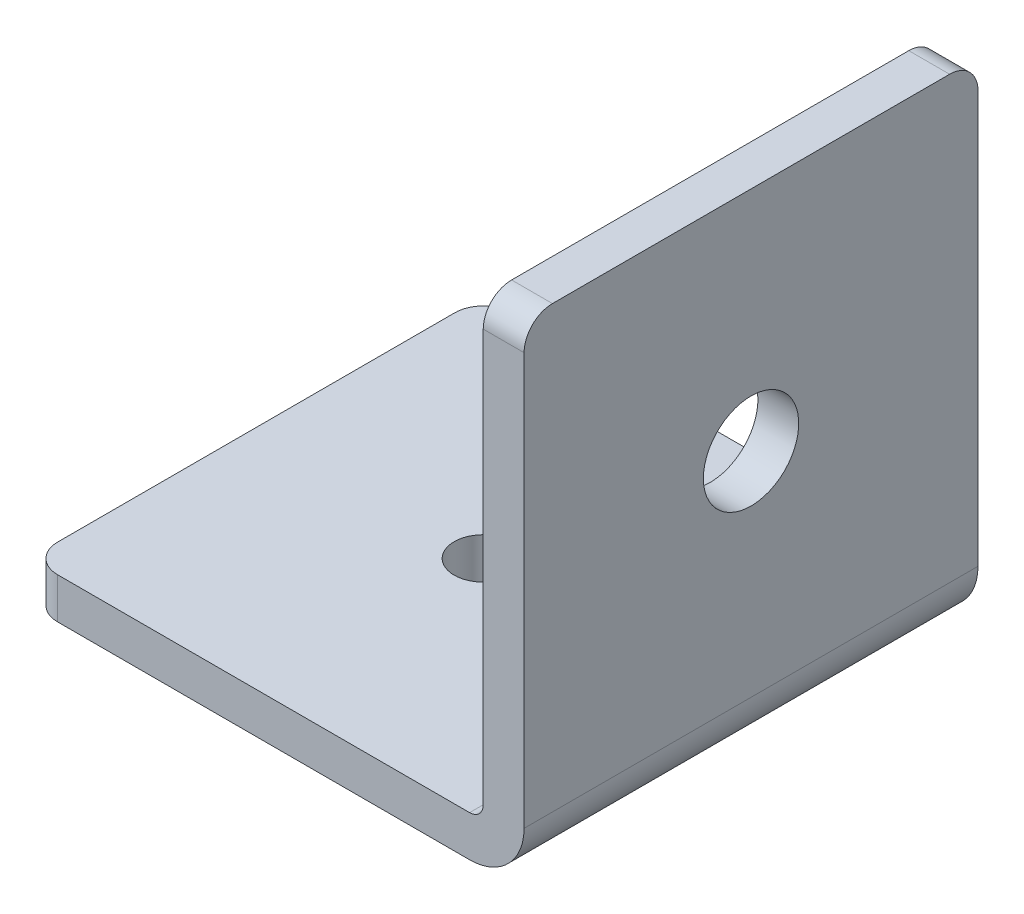
ISO-10303-21;
HEADER;
FILE_DESCRIPTION(('STEP AP214'),'2;1');
FILE_NAME('part.step','',(''),(''),'','','');
FILE_SCHEMA(('AUTOMOTIVE_DESIGN { 1 0 10303 214 1 1 1 1 }'));
ENDSEC;
DATA;
#1=APPLICATION_CONTEXT('core data for automotive mechanical design processes');
#2=APPLICATION_PROTOCOL_DEFINITION('international standard','automotive_design',2000,#1);
#3=PRODUCT_CONTEXT('',#1,'mechanical');
#4=PRODUCT('Part','Part','',(#3));
#5=PRODUCT_RELATED_PRODUCT_CATEGORY('part','',(#4));
#6=PRODUCT_DEFINITION_FORMATION('','',#4);
#7=PRODUCT_DEFINITION_CONTEXT('part definition',#1,'design');
#8=PRODUCT_DEFINITION('design','',#6,#7);
#9=PRODUCT_DEFINITION_SHAPE('','',#8);
#10=(LENGTH_UNIT() NAMED_UNIT(*) SI_UNIT(.MILLI.,.METRE.));
#11=(NAMED_UNIT(*) PLANE_ANGLE_UNIT() SI_UNIT($,.RADIAN.));
#12=(NAMED_UNIT(*) SI_UNIT($,.STERADIAN.) SOLID_ANGLE_UNIT());
#13=UNCERTAINTY_MEASURE_WITH_UNIT(LENGTH_MEASURE(1.E-05),#10,'distance_accuracy_value','');
#14=(GEOMETRIC_REPRESENTATION_CONTEXT(3) GLOBAL_UNCERTAINTY_ASSIGNED_CONTEXT((#13)) GLOBAL_UNIT_ASSIGNED_CONTEXT((#10,
#11,#12)) REPRESENTATION_CONTEXT('',''));
#15=CARTESIAN_POINT('',(0.,0.,0.));
#16=DIRECTION('',(0.,0.,1.));
#17=DIRECTION('',(1.,0.,0.));
#18=AXIS2_PLACEMENT_3D('',#15,#16,#17);
#19=CARTESIAN_POINT('',(25.4,27.686,-23.8125));
#20=DIRECTION('',(0.,-1.,0.));
#21=DIRECTION('',(1.,0.,0.));
#22=AXIS2_PLACEMENT_3D('',#19,#20,#21);
#23=PLANE('',#22);
#24=DIRECTION('',(1.,0.,0.));
#25=VECTOR('',#24,1.);
#26=CARTESIAN_POINT('',(26.543,27.686,-23.8125000006512));
#27=LINE('',#26,#25);
#28=CARTESIAN_POINT('',(27.686,27.686,-23.8125000003256));
#29=VERTEX_POINT('',#28);
#30=CARTESIAN_POINT('',(25.4,27.686,-23.8125000003256));
#31=VERTEX_POINT('',#30);
#32=EDGE_CURVE('E90',#29,#31,#27,.F.);
#33=ORIENTED_EDGE('',*,*,#32,.T.);
#34=DIRECTION('',(0.,0.,-1.));
#35=VECTOR('',#34,1.);
#36=CARTESIAN_POINT('',(25.4,27.686,-12.7));
#37=LINE('',#36,#35);
#38=CARTESIAN_POINT('',(25.4,27.686,-1.5875000003256));
#39=VERTEX_POINT('',#38);
#40=EDGE_CURVE('E80',#39,#31,#37,.T.);
#41=ORIENTED_EDGE('',*,*,#40,.F.);
#42=DIRECTION('',(-1.,0.,0.));
#43=VECTOR('',#42,1.);
#44=CARTESIAN_POINT('',(26.543,27.686,-1.5875000006512));
#45=LINE('',#44,#43);
#46=CARTESIAN_POINT('',(27.686,27.686,-1.5875000003256));
#47=VERTEX_POINT('',#46);
#48=EDGE_CURVE('E106',#39,#47,#45,.F.);
#49=ORIENTED_EDGE('',*,*,#48,.T.);
#50=DIRECTION('',(0.,0.,-1.));
#51=VECTOR('',#50,1.);
#52=CARTESIAN_POINT('',(27.686,27.686,-12.7));
#53=LINE('',#52,#51);
#54=EDGE_CURVE('E94',#47,#29,#53,.T.);
#55=ORIENTED_EDGE('',*,*,#54,.T.);
#56=EDGE_LOOP('',(#33,#41,#49,#55));
#57=FACE_BOUND('',#56,.T.);
#58=ADVANCED_FACE('F17',(#57),#23,.F.);
#59=CARTESIAN_POINT('',(27.686,14.986,-12.7));
#60=DIRECTION('',(-1.,0.,0.));
#61=DIRECTION('',(0.,0.,1.));
#62=AXIS2_PLACEMENT_3D('',#59,#60,#61);
#63=CYLINDRICAL_SURFACE('',#62,2.667);
#64=CARTESIAN_POINT('',(25.4,14.986,-12.7));
#65=DIRECTION('',(-1.,0.,0.));
#66=DIRECTION('',(0.,0.,1.));
#67=AXIS2_PLACEMENT_3D('',#64,#65,#66);
#68=CIRCLE('',#67,2.667);
#69=CARTESIAN_POINT('',(25.4,14.986,-10.033));
#70=VERTEX_POINT('',#69);
#71=EDGE_CURVE('E102',#70,#70,#68,.F.);
#72=ORIENTED_EDGE('',*,*,#71,.F.);
#73=EDGE_LOOP('',(#72));
#74=FACE_BOUND('',#73,.T.);
#75=CARTESIAN_POINT('',(27.686,14.986,-12.7));
#76=DIRECTION('',(-1.,0.,0.));
#77=DIRECTION('',(0.,0.,1.));
#78=AXIS2_PLACEMENT_3D('',#75,#76,#77);
#79=CIRCLE('',#78,2.667);
#80=CARTESIAN_POINT('',(27.686,14.986,-10.033));
#81=VERTEX_POINT('',#80);
#82=EDGE_CURVE('E114',#81,#81,#79,.F.);
#83=ORIENTED_EDGE('',*,*,#82,.T.);
#84=EDGE_LOOP('',(#83));
#85=FACE_BOUND('',#84,.T.);
#86=ADVANCED_FACE('F371',(#74,#85),#63,.F.);
#87=CARTESIAN_POINT('',(27.686,26.0985,-23.8125));
#88=DIRECTION('',(-1.,0.,0.));
#89=DIRECTION('',(0.,0.,1.));
#90=AXIS2_PLACEMENT_3D('',#87,#88,#89);
#91=CYLINDRICAL_SURFACE('',#90,1.58749999999999);
#92=CARTESIAN_POINT('',(27.686,26.0985,-23.8125));
#93=DIRECTION('',(-1.,0.,0.));
#94=DIRECTION('',(0.,0.,1.));
#95=AXIS2_PLACEMENT_3D('',#92,#93,#94);
#96=CIRCLE('',#95,1.58749999999999);
#97=CARTESIAN_POINT('',(27.686,26.0985,-25.4));
#98=VERTEX_POINT('',#97);
#99=EDGE_CURVE('E112',#29,#98,#96,.T.);
#100=ORIENTED_EDGE('',*,*,#99,.T.);
#101=DIRECTION('',(-1.,0.,0.));
#102=VECTOR('',#101,1.);
#103=CARTESIAN_POINT('',(14.63675,26.0985,-25.4));
#104=LINE('',#103,#102);
#105=CARTESIAN_POINT('',(25.3999999983807,26.0985,-25.4));
#106=VERTEX_POINT('',#105);
#107=EDGE_CURVE('E101',#98,#106,#104,.T.);
#108=ORIENTED_EDGE('',*,*,#107,.T.);
#109=CARTESIAN_POINT('',(25.4,26.0985,-23.8125));
#110=DIRECTION('',(-1.,0.,0.));
#111=DIRECTION('',(0.,0.,1.));
#112=AXIS2_PLACEMENT_3D('',#109,#110,#111);
#113=CIRCLE('',#112,1.58749999999999);
#114=EDGE_CURVE('E21',#31,#106,#113,.T.);
#115=ORIENTED_EDGE('',*,*,#114,.F.);
#116=ORIENTED_EDGE('',*,*,#32,.F.);
#117=EDGE_LOOP('',(#100,#108,#115,#116));
#118=FACE_BOUND('',#117,.T.);
#119=ADVANCED_FACE('F99',(#118),#91,.T.);
#120=CARTESIAN_POINT('',(25.4,27.686,-25.4));
#121=DIRECTION('',(-1.,0.,0.));
#122=DIRECTION('',(0.,-1.,0.));
#123=AXIS2_PLACEMENT_3D('',#120,#121,#122);
#124=PLANE('',#123);
#125=ORIENTED_EDGE('',*,*,#71,.T.);
#126=EDGE_LOOP('',(#125));
#127=FACE_BOUND('',#126,.T.);
#128=ORIENTED_EDGE('',*,*,#114,.T.);
#129=DIRECTION('',(0.,-1.,0.));
#130=VECTOR('',#129,1.);
#131=CARTESIAN_POINT('',(25.3999999967615,13.04925,-25.4));
#132=LINE('',#131,#130);
#133=CARTESIAN_POINT('',(25.3999999983808,3.04799999984371,-25.4));
#134=VERTEX_POINT('',#133);
#135=EDGE_CURVE('E156',#106,#134,#132,.T.);
#136=ORIENTED_EDGE('',*,*,#135,.T.);
#137=DIRECTION('',(0.,0.,1.));
#138=VECTOR('',#137,1.);
#139=CARTESIAN_POINT('',(25.4,3.04799999968742,-12.7));
#140=LINE('',#139,#138);
#141=CARTESIAN_POINT('',(25.3999999983808,3.04799999984371,0.));
#142=VERTEX_POINT('',#141);
#143=EDGE_CURVE('E126',#142,#134,#140,.F.);
#144=ORIENTED_EDGE('',*,*,#143,.F.);
#145=DIRECTION('',(0.,1.,0.));
#146=VECTOR('',#145,1.);
#147=CARTESIAN_POINT('',(25.3999999967615,13.04925,0.));
#148=LINE('',#147,#146);
#149=CARTESIAN_POINT('',(25.3999999983807,26.0985,0.));
#150=VERTEX_POINT('',#149);
#151=EDGE_CURVE('E128',#142,#150,#148,.T.);
#152=ORIENTED_EDGE('',*,*,#151,.T.);
#153=CARTESIAN_POINT('',(25.4,26.0985,-1.5875));
#154=DIRECTION('',(-1.,0.,0.));
#155=DIRECTION('',(0.,0.,1.));
#156=AXIS2_PLACEMENT_3D('',#153,#154,#155);
#157=CIRCLE('',#156,1.58749999999999);
#158=EDGE_CURVE('E87',#150,#39,#157,.T.);
#159=ORIENTED_EDGE('',*,*,#158,.T.);
#160=ORIENTED_EDGE('',*,*,#40,.T.);
#161=EDGE_LOOP('',(#128,#136,#144,#152,#159,#160));
#162=FACE_BOUND('',#161,.T.);
#163=ADVANCED_FACE('F82',(#127,#162),#124,.T.);
#164=CARTESIAN_POINT('',(27.686,26.0985,-1.5875));
#165=DIRECTION('',(-1.,0.,0.));
#166=DIRECTION('',(0.,0.,1.));
#167=AXIS2_PLACEMENT_3D('',#164,#165,#166);
#168=CYLINDRICAL_SURFACE('',#167,1.58749999999999);
#169=CARTESIAN_POINT('',(27.686,26.0985,-1.5875));
#170=DIRECTION('',(-1.,0.,0.));
#171=DIRECTION('',(0.,0.,1.));
#172=AXIS2_PLACEMENT_3D('',#169,#170,#171);
#173=CIRCLE('',#172,1.58749999999999);
#174=CARTESIAN_POINT('',(27.686,26.0985,0.));
#175=VERTEX_POINT('',#174);
#176=EDGE_CURVE('E109',#175,#47,#173,.T.);
#177=ORIENTED_EDGE('',*,*,#176,.T.);
#178=ORIENTED_EDGE('',*,*,#48,.F.);
#179=ORIENTED_EDGE('',*,*,#158,.F.);
#180=DIRECTION('',(1.,0.,0.));
#181=VECTOR('',#180,1.);
#182=CARTESIAN_POINT('',(14.63675,26.0985,0.));
#183=LINE('',#182,#181);
#184=EDGE_CURVE('E158',#150,#175,#183,.T.);
#185=ORIENTED_EDGE('',*,*,#184,.T.);
#186=EDGE_LOOP('',(#177,#178,#179,#185));
#187=FACE_BOUND('',#186,.T.);
#188=ADVANCED_FACE('F245',(#187),#168,.T.);
#189=CARTESIAN_POINT('',(27.686,27.686,-25.4));
#190=DIRECTION('',(-1.,0.,0.));
#191=DIRECTION('',(0.,-1.,0.));
#192=AXIS2_PLACEMENT_3D('',#189,#190,#191);
#193=PLANE('',#192);
#194=ORIENTED_EDGE('',*,*,#82,.F.);
#195=EDGE_LOOP('',(#194));
#196=FACE_BOUND('',#195,.T.);
#197=DIRECTION('',(0.,0.,1.));
#198=VECTOR('',#197,1.);
#199=CARTESIAN_POINT('',(27.686,3.04799999874969,-12.7));
#200=LINE('',#199,#198);
#201=CARTESIAN_POINT('',(27.686,3.04799999937484,0.));
#202=VERTEX_POINT('',#201);
#203=CARTESIAN_POINT('',(27.686,3.04799999937484,-25.4));
#204=VERTEX_POINT('',#203);
#205=EDGE_CURVE('E117',#202,#204,#200,.F.);
#206=ORIENTED_EDGE('',*,*,#205,.T.);
#207=DIRECTION('',(0.,1.,0.));
#208=VECTOR('',#207,1.);
#209=CARTESIAN_POINT('',(27.686,13.04925,-25.4));
#210=LINE('',#209,#208);
#211=EDGE_CURVE('E121',#204,#98,#210,.T.);
#212=ORIENTED_EDGE('',*,*,#211,.T.);
#213=ORIENTED_EDGE('',*,*,#99,.F.);
#214=ORIENTED_EDGE('',*,*,#54,.F.);
#215=ORIENTED_EDGE('',*,*,#176,.F.);
#216=DIRECTION('',(0.,-1.,0.));
#217=VECTOR('',#216,1.);
#218=CARTESIAN_POINT('',(27.686,13.04925,0.));
#219=LINE('',#218,#217);
#220=EDGE_CURVE('E133',#175,#202,#219,.T.);
#221=ORIENTED_EDGE('',*,*,#220,.T.);
#222=EDGE_LOOP('',(#206,#212,#213,#214,#215,#221));
#223=FACE_BOUND('',#222,.T.);
#224=ADVANCED_FACE('F243',(#196,#223),#193,.F.);
#225=CARTESIAN_POINT('',(24.638,3.048,0.));
#226=DIRECTION('',(0.,0.,-1.));
#227=DIRECTION('',(-1.,0.,0.));
#228=AXIS2_PLACEMENT_3D('',#225,#226,#227);
#229=CYLINDRICAL_SURFACE('',#228,3.048);
#230=DIRECTION('',(0.,0.,1.));
#231=VECTOR('',#230,1.);
#232=CARTESIAN_POINT('',(24.638,0.,-12.7));
#233=LINE('',#232,#231);
#234=CARTESIAN_POINT('',(24.638,0.,-25.4));
#235=VERTEX_POINT('',#234);
#236=CARTESIAN_POINT('',(24.638,0.,0.));
#237=VERTEX_POINT('',#236);
#238=EDGE_CURVE('E132',#235,#237,#233,.T.);
#239=ORIENTED_EDGE('',*,*,#238,.F.);
#240=CARTESIAN_POINT('',(24.638,3.048,-25.4));
#241=DIRECTION('',(0.,0.,-1.));
#242=DIRECTION('',(-1.,0.,0.));
#243=AXIS2_PLACEMENT_3D('',#240,#241,#242);
#244=CIRCLE('',#243,3.048);
#245=EDGE_CURVE('E118',#235,#204,#244,.F.);
#246=ORIENTED_EDGE('',*,*,#245,.T.);
#247=ORIENTED_EDGE('',*,*,#205,.F.);
#248=CARTESIAN_POINT('',(24.638,3.048,0.));
#249=DIRECTION('',(0.,0.,-1.));
#250=DIRECTION('',(-1.,0.,0.));
#251=AXIS2_PLACEMENT_3D('',#248,#249,#250);
#252=CIRCLE('',#251,3.048);
#253=EDGE_CURVE('E129',#202,#237,#252,.T.);
#254=ORIENTED_EDGE('',*,*,#253,.T.);
#255=EDGE_LOOP('',(#239,#246,#247,#254));
#256=FACE_BOUND('',#255,.T.);
#257=ADVANCED_FACE('F238',(#256),#229,.T.);
#258=CARTESIAN_POINT('',(1.5875,0.,-1.5875));
#259=DIRECTION('',(0.,1.,0.));
#260=DIRECTION('',(0.,0.,1.));
#261=AXIS2_PLACEMENT_3D('',#258,#259,#260);
#262=CYLINDRICAL_SURFACE('',#261,1.5875);
#263=CARTESIAN_POINT('',(1.5875,0.,-1.5875));
#264=DIRECTION('',(0.,1.,0.));
#265=DIRECTION('',(0.,0.,1.));
#266=AXIS2_PLACEMENT_3D('',#263,#264,#265);
#267=CIRCLE('',#266,1.5875);
#268=CARTESIAN_POINT('',(1.5875,0.,0.));
#269=VERTEX_POINT('',#268);
#270=CARTESIAN_POINT('',(0.,0.,-1.5875));
#271=VERTEX_POINT('',#270);
#272=EDGE_CURVE('E134',#269,#271,#267,.F.);
#273=ORIENTED_EDGE('',*,*,#272,.F.);
#274=DIRECTION('',(0.,1.,0.));
#275=VECTOR('',#274,1.);
#276=CARTESIAN_POINT('',(1.5875,13.04925,0.));
#277=LINE('',#276,#275);
#278=CARTESIAN_POINT('',(1.5875,2.286,0.));
#279=VERTEX_POINT('',#278);
#280=EDGE_CURVE('E125',#269,#279,#277,.T.);
#281=ORIENTED_EDGE('',*,*,#280,.T.);
#282=CARTESIAN_POINT('',(1.5875,2.286,-1.5875));
#283=DIRECTION('',(0.,1.,0.));
#284=DIRECTION('',(0.,0.,1.));
#285=AXIS2_PLACEMENT_3D('',#282,#283,#284);
#286=CIRCLE('',#285,1.5875);
#287=CARTESIAN_POINT('',(0.,2.286,-1.5875));
#288=VERTEX_POINT('',#287);
#289=EDGE_CURVE('E143',#279,#288,#286,.F.);
#290=ORIENTED_EDGE('',*,*,#289,.T.);
#291=DIRECTION('',(0.,-1.,0.));
#292=VECTOR('',#291,1.);
#293=CARTESIAN_POINT('',(0.,1.143,-1.5875));
#294=LINE('',#293,#292);
#295=EDGE_CURVE('E163',#288,#271,#294,.T.);
#296=ORIENTED_EDGE('',*,*,#295,.T.);
#297=EDGE_LOOP('',(#273,#281,#290,#296));
#298=FACE_BOUND('',#297,.T.);
#299=ADVANCED_FACE('F273',(#298),#262,.T.);
#300=CARTESIAN_POINT('',(0.,0.,-1.5875));
#301=DIRECTION('',(1.,0.,0.));
#302=DIRECTION('',(0.,0.,-1.));
#303=AXIS2_PLACEMENT_3D('',#300,#301,#302);
#304=PLANE('',#303);
#305=DIRECTION('',(0.,1.,0.));
#306=VECTOR('',#305,1.);
#307=CARTESIAN_POINT('',(0.,1.143,-23.8125000006107));
#308=LINE('',#307,#306);
#309=CARTESIAN_POINT('',(0.,2.286,-23.8125000003053));
#310=VERTEX_POINT('',#309);
#311=CARTESIAN_POINT('',(0.,0.,-23.8125000003053));
#312=VERTEX_POINT('',#311);
#313=EDGE_CURVE('E168',#310,#312,#308,.F.);
#314=ORIENTED_EDGE('',*,*,#313,.T.);
#315=DIRECTION('',(0.,0.,-1.));
#316=VECTOR('',#315,1.);
#317=CARTESIAN_POINT('',(0.,0.,-12.7));
#318=LINE('',#317,#316);
#319=EDGE_CURVE('E137',#271,#312,#318,.T.);
#320=ORIENTED_EDGE('',*,*,#319,.F.);
#321=ORIENTED_EDGE('',*,*,#295,.F.);
#322=DIRECTION('',(0.,0.,-1.));
#323=VECTOR('',#322,1.);
#324=CARTESIAN_POINT('',(0.,2.286,-12.7));
#325=LINE('',#324,#323);
#326=EDGE_CURVE('E146',#288,#310,#325,.T.);
#327=ORIENTED_EDGE('',*,*,#326,.T.);
#328=EDGE_LOOP('',(#314,#320,#321,#327));
#329=FACE_BOUND('',#328,.T.);
#330=ADVANCED_FACE('F226',(#329),#304,.F.);
#331=CARTESIAN_POINT('',(1.5875,0.,-23.8125));
#332=DIRECTION('',(0.,1.,0.));
#333=DIRECTION('',(0.,0.,1.));
#334=AXIS2_PLACEMENT_3D('',#331,#332,#333);
#335=CYLINDRICAL_SURFACE('',#334,1.5875);
#336=CARTESIAN_POINT('',(1.5875,0.,-23.8125));
#337=DIRECTION('',(0.,1.,0.));
#338=DIRECTION('',(0.,0.,1.));
#339=AXIS2_PLACEMENT_3D('',#336,#337,#338);
#340=CIRCLE('',#339,1.5875);
#341=CARTESIAN_POINT('',(1.5875,0.,-25.4));
#342=VERTEX_POINT('',#341);
#343=EDGE_CURVE('E139',#312,#342,#340,.F.);
#344=ORIENTED_EDGE('',*,*,#343,.F.);
#345=ORIENTED_EDGE('',*,*,#313,.F.);
#346=CARTESIAN_POINT('',(1.5875,2.286,-23.8125));
#347=DIRECTION('',(0.,1.,0.));
#348=DIRECTION('',(0.,0.,1.));
#349=AXIS2_PLACEMENT_3D('',#346,#347,#348);
#350=CIRCLE('',#349,1.5875);
#351=CARTESIAN_POINT('',(1.5875,2.286,-25.4));
#352=VERTEX_POINT('',#351);
#353=EDGE_CURVE('E147',#310,#352,#350,.F.);
#354=ORIENTED_EDGE('',*,*,#353,.T.);
#355=DIRECTION('',(0.,-1.,0.));
#356=VECTOR('',#355,1.);
#357=CARTESIAN_POINT('',(1.5875,13.04925,-25.4));
#358=LINE('',#357,#356);
#359=EDGE_CURVE('E122',#352,#342,#358,.T.);
#360=ORIENTED_EDGE('',*,*,#359,.T.);
#361=EDGE_LOOP('',(#344,#345,#354,#360));
#362=FACE_BOUND('',#361,.T.);
#363=ADVANCED_FACE('F221',(#362),#335,.T.);
#364=CARTESIAN_POINT('',(1.5875,0.,-25.4));
#365=DIRECTION('',(0.,0.,1.));
#366=DIRECTION('',(1.,0.,0.));
#367=AXIS2_PLACEMENT_3D('',#364,#365,#366);
#368=PLANE('',#367);
#369=CARTESIAN_POINT('',(24.638,3.048,-25.4));
#370=DIRECTION('',(0.,0.,-1.));
#371=DIRECTION('',(-1.,0.,0.));
#372=AXIS2_PLACEMENT_3D('',#369,#370,#371);
#373=CIRCLE('',#372,0.762000000000002);
#374=CARTESIAN_POINT('',(24.638,2.286,-25.4));
#375=VERTEX_POINT('',#374);
#376=EDGE_CURVE('E123',#134,#375,#373,.T.);
#377=ORIENTED_EDGE('',*,*,#376,.F.);
#378=ORIENTED_EDGE('',*,*,#135,.F.);
#379=ORIENTED_EDGE('',*,*,#107,.F.);
#380=ORIENTED_EDGE('',*,*,#211,.F.);
#381=ORIENTED_EDGE('',*,*,#245,.F.);
#382=DIRECTION('',(1.,0.,0.));
#383=VECTOR('',#382,1.);
#384=CARTESIAN_POINT('',(12.319,0.,-25.4));
#385=LINE('',#384,#383);
#386=EDGE_CURVE('E142',#342,#235,#385,.T.);
#387=ORIENTED_EDGE('',*,*,#386,.F.);
#388=ORIENTED_EDGE('',*,*,#359,.F.);
#389=DIRECTION('',(1.,0.,0.));
#390=VECTOR('',#389,1.);
#391=CARTESIAN_POINT('',(12.319,2.286,-25.4));
#392=LINE('',#391,#390);
#393=EDGE_CURVE('E150',#352,#375,#392,.T.);
#394=ORIENTED_EDGE('',*,*,#393,.T.);
#395=EDGE_LOOP('',(#377,#378,#379,#380,#381,#387,#388,#394));
#396=FACE_BOUND('',#395,.T.);
#397=ADVANCED_FACE('F212',(#396),#368,.F.);
#398=CARTESIAN_POINT('',(24.638,3.048,0.));
#399=DIRECTION('',(0.,0.,-1.));
#400=DIRECTION('',(-1.,0.,0.));
#401=AXIS2_PLACEMENT_3D('',#398,#399,#400);
#402=CYLINDRICAL_SURFACE('',#401,0.762000000000002);
#403=DIRECTION('',(0.,0.,1.));
#404=VECTOR('',#403,1.);
#405=CARTESIAN_POINT('',(24.638,2.286,-12.7));
#406=LINE('',#405,#404);
#407=CARTESIAN_POINT('',(24.638,2.286,0.));
#408=VERTEX_POINT('',#407);
#409=EDGE_CURVE('E178',#375,#408,#406,.T.);
#410=ORIENTED_EDGE('',*,*,#409,.T.);
#411=CARTESIAN_POINT('',(24.638,3.048,0.));
#412=DIRECTION('',(0.,0.,-1.));
#413=DIRECTION('',(-1.,0.,0.));
#414=AXIS2_PLACEMENT_3D('',#411,#412,#413);
#415=CIRCLE('',#414,0.762000000000002);
#416=EDGE_CURVE('E36',#408,#142,#415,.F.);
#417=ORIENTED_EDGE('',*,*,#416,.T.);
#418=ORIENTED_EDGE('',*,*,#143,.T.);
#419=ORIENTED_EDGE('',*,*,#376,.T.);
#420=EDGE_LOOP('',(#410,#417,#418,#419));
#421=FACE_BOUND('',#420,.T.);
#422=ADVANCED_FACE('F209',(#421),#402,.F.);
#423=CARTESIAN_POINT('',(27.686,0.,0.));
#424=DIRECTION('',(0.,0.,-1.));
#425=DIRECTION('',(-1.,0.,0.));
#426=AXIS2_PLACEMENT_3D('',#423,#424,#425);
#427=PLANE('',#426);
#428=ORIENTED_EDGE('',*,*,#253,.F.);
#429=ORIENTED_EDGE('',*,*,#220,.F.);
#430=ORIENTED_EDGE('',*,*,#184,.F.);
#431=ORIENTED_EDGE('',*,*,#151,.F.);
#432=ORIENTED_EDGE('',*,*,#416,.F.);
#433=DIRECTION('',(-1.,0.,0.));
#434=VECTOR('',#433,1.);
#435=CARTESIAN_POINT('',(12.319,2.286,0.));
#436=LINE('',#435,#434);
#437=EDGE_CURVE('E152',#408,#279,#436,.T.);
#438=ORIENTED_EDGE('',*,*,#437,.T.);
#439=ORIENTED_EDGE('',*,*,#280,.F.);
#440=DIRECTION('',(-1.,0.,0.));
#441=VECTOR('',#440,1.);
#442=CARTESIAN_POINT('',(12.319,0.,0.));
#443=LINE('',#442,#441);
#444=EDGE_CURVE('E138',#237,#269,#443,.T.);
#445=ORIENTED_EDGE('',*,*,#444,.F.);
#446=EDGE_LOOP('',(#428,#429,#430,#431,#432,#438,#439,#445));
#447=FACE_BOUND('',#446,.T.);
#448=ADVANCED_FACE('F197',(#447),#427,.F.);
#449=CARTESIAN_POINT('',(0.,0.,0.));
#450=DIRECTION('',(0.,-1.,0.));
#451=DIRECTION('',(0.,0.,-1.));
#452=AXIS2_PLACEMENT_3D('',#449,#450,#451);
#453=PLANE('',#452);
#454=CARTESIAN_POINT('',(12.7,0.,-12.7));
#455=DIRECTION('',(0.,1.,0.));
#456=DIRECTION('',(0.,0.,1.));
#457=AXIS2_PLACEMENT_3D('',#454,#455,#456);
#458=CIRCLE('',#457,1.6256);
#459=CARTESIAN_POINT('',(12.7,0.,-11.0744));
#460=VERTEX_POINT('',#459);
#461=EDGE_CURVE('E27',#460,#460,#458,.F.);
#462=ORIENTED_EDGE('',*,*,#461,.F.);
#463=EDGE_LOOP('',(#462));
#464=FACE_BOUND('',#463,.T.);
#465=ORIENTED_EDGE('',*,*,#343,.T.);
#466=ORIENTED_EDGE('',*,*,#386,.T.);
#467=ORIENTED_EDGE('',*,*,#238,.T.);
#468=ORIENTED_EDGE('',*,*,#444,.T.);
#469=ORIENTED_EDGE('',*,*,#272,.T.);
#470=ORIENTED_EDGE('',*,*,#319,.T.);
#471=EDGE_LOOP('',(#465,#466,#467,#468,#469,#470));
#472=FACE_BOUND('',#471,.T.);
#473=ADVANCED_FACE('F265',(#464,#472),#453,.T.);
#474=CARTESIAN_POINT('',(0.,2.286,0.));
#475=DIRECTION('',(0.,-1.,0.));
#476=DIRECTION('',(0.,0.,-1.));
#477=AXIS2_PLACEMENT_3D('',#474,#475,#476);
#478=PLANE('',#477);
#479=CARTESIAN_POINT('',(12.7,2.286,-12.7));
#480=DIRECTION('',(0.,1.,0.));
#481=DIRECTION('',(0.,0.,1.));
#482=AXIS2_PLACEMENT_3D('',#479,#480,#481);
#483=CIRCLE('',#482,1.6256);
#484=CARTESIAN_POINT('',(12.7,2.286,-11.0744));
#485=VERTEX_POINT('',#484);
#486=EDGE_CURVE('E11',#485,#485,#483,.T.);
#487=ORIENTED_EDGE('',*,*,#486,.F.);
#488=EDGE_LOOP('',(#487));
#489=FACE_BOUND('',#488,.T.);
#490=ORIENTED_EDGE('',*,*,#409,.F.);
#491=ORIENTED_EDGE('',*,*,#393,.F.);
#492=ORIENTED_EDGE('',*,*,#353,.F.);
#493=ORIENTED_EDGE('',*,*,#326,.F.);
#494=ORIENTED_EDGE('',*,*,#289,.F.);
#495=ORIENTED_EDGE('',*,*,#437,.F.);
#496=EDGE_LOOP('',(#490,#491,#492,#493,#494,#495));
#497=FACE_BOUND('',#496,.T.);
#498=ADVANCED_FACE('F19',(#489,#497),#478,.F.);
#499=CARTESIAN_POINT('',(12.7,0.,-12.7));
#500=DIRECTION('',(0.,1.,0.));
#501=DIRECTION('',(0.,0.,1.));
#502=AXIS2_PLACEMENT_3D('',#499,#500,#501);
#503=CYLINDRICAL_SURFACE('',#502,1.6256);
#504=ORIENTED_EDGE('',*,*,#486,.T.);
#505=EDGE_LOOP('',(#504));
#506=FACE_BOUND('',#505,.T.);
#507=ORIENTED_EDGE('',*,*,#461,.T.);
#508=EDGE_LOOP('',(#507));
#509=FACE_BOUND('',#508,.T.);
#510=ADVANCED_FACE('F258',(#506,#509),#503,.F.);
#511=CLOSED_SHELL('',(#58,#86,#119,#163,#188,#224,#257,#299,#330,#363,#397,#422,#448,#473,#498,#510));
#512=MANIFOLD_SOLID_BREP('B1',#511);
#513=ADVANCED_BREP_SHAPE_REPRESENTATION('',(#18,#512),#14);
#514=SHAPE_DEFINITION_REPRESENTATION(#9,#513);
ENDSEC;
END-ISO-10303-21;
